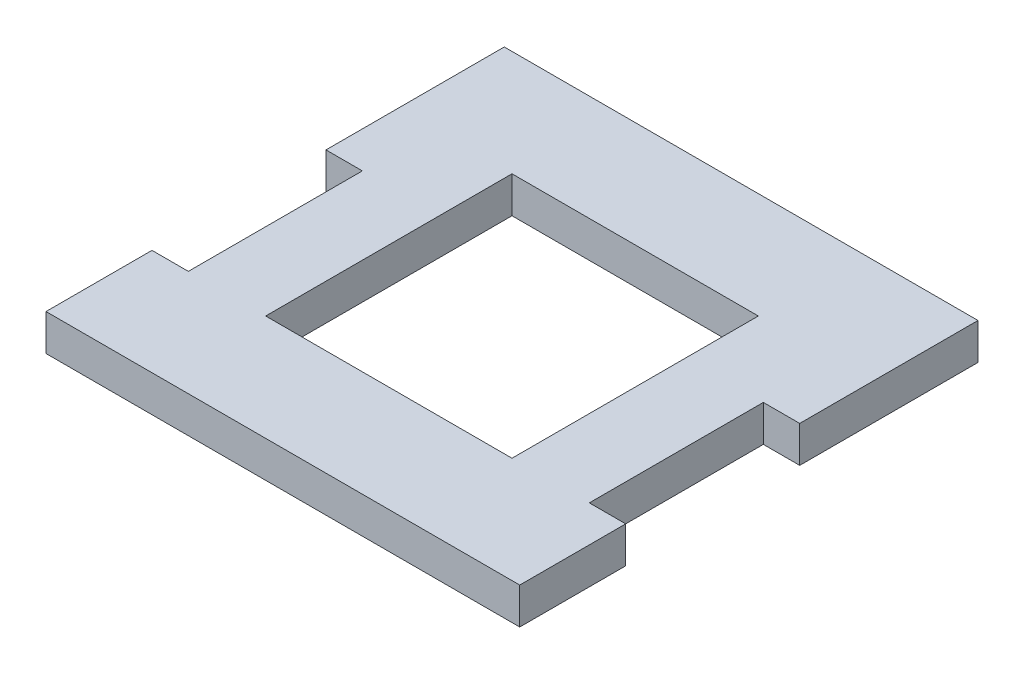
ISO-10303-21;
HEADER;
FILE_DESCRIPTION(('STEP AP214'),'2;1');
FILE_NAME('part.step','',(''),(''),'','','');
FILE_SCHEMA(('AUTOMOTIVE_DESIGN { 1 0 10303 214 1 1 1 1 }'));
ENDSEC;
DATA;
#1=APPLICATION_CONTEXT('core data for automotive mechanical design processes');
#2=APPLICATION_PROTOCOL_DEFINITION('international standard','automotive_design',2000,#1);
#3=PRODUCT_CONTEXT('',#1,'mechanical');
#4=PRODUCT('Part','Part','',(#3));
#5=PRODUCT_RELATED_PRODUCT_CATEGORY('part','',(#4));
#6=PRODUCT_DEFINITION_FORMATION('','',#4);
#7=PRODUCT_DEFINITION_CONTEXT('part definition',#1,'design');
#8=PRODUCT_DEFINITION('design','',#6,#7);
#9=PRODUCT_DEFINITION_SHAPE('','',#8);
#10=(LENGTH_UNIT() NAMED_UNIT(*) SI_UNIT(.MILLI.,.METRE.));
#11=(NAMED_UNIT(*) PLANE_ANGLE_UNIT() SI_UNIT($,.RADIAN.));
#12=(NAMED_UNIT(*) SI_UNIT($,.STERADIAN.) SOLID_ANGLE_UNIT());
#13=UNCERTAINTY_MEASURE_WITH_UNIT(LENGTH_MEASURE(1.E-05),#10,'distance_accuracy_value','');
#14=(GEOMETRIC_REPRESENTATION_CONTEXT(3) GLOBAL_UNCERTAINTY_ASSIGNED_CONTEXT((#13)) GLOBAL_UNIT_ASSIGNED_CONTEXT((#10,
#11,#12)) REPRESENTATION_CONTEXT('',''));
#15=CARTESIAN_POINT('',(0.,0.,0.));
#16=DIRECTION('',(0.,0.,1.));
#17=DIRECTION('',(1.,0.,0.));
#18=AXIS2_PLACEMENT_3D('',#15,#16,#17);
#19=CARTESIAN_POINT('',(0.,3.175,0.));
#20=DIRECTION('',(1.,0.,0.));
#21=DIRECTION('',(0.,0.,-1.));
#22=AXIS2_PLACEMENT_3D('',#19,#20,#21);
#23=PLANE('',#22);
#24=DIRECTION('',(0.,0.,1.));
#25=VECTOR('',#24,1.);
#26=CARTESIAN_POINT('',(0.,3.175,0.));
#27=LINE('',#26,#25);
#28=CARTESIAN_POINT('',(0.,3.175,-9.25000000000001));
#29=VERTEX_POINT('',#28);
#30=CARTESIAN_POINT('',(0.,3.175,0.));
#31=VERTEX_POINT('',#30);
#32=EDGE_CURVE('E240',#29,#31,#27,.T.);
#33=ORIENTED_EDGE('',*,*,#32,.F.);
#34=DIRECTION('',(0.,1.,0.));
#35=VECTOR('',#34,1.);
#36=CARTESIAN_POINT('',(0.,0.,-9.25000000000001));
#37=LINE('',#36,#35);
#38=CARTESIAN_POINT('',(0.,0.,-9.25000000000001));
#39=VERTEX_POINT('',#38);
#40=EDGE_CURVE('E178',#39,#29,#37,.T.);
#41=ORIENTED_EDGE('',*,*,#40,.F.);
#42=DIRECTION('',(0.,0.,1.));
#43=VECTOR('',#42,1.);
#44=CARTESIAN_POINT('',(0.,0.,0.));
#45=LINE('',#44,#43);
#46=CARTESIAN_POINT('',(0.,0.,0.));
#47=VERTEX_POINT('',#46);
#48=EDGE_CURVE('E235',#39,#47,#45,.T.);
#49=ORIENTED_EDGE('',*,*,#48,.T.);
#50=DIRECTION('',(0.,-1.,0.));
#51=VECTOR('',#50,1.);
#52=CARTESIAN_POINT('',(0.,3.175,0.));
#53=LINE('',#52,#51);
#54=EDGE_CURVE('E11',#31,#47,#53,.T.);
#55=ORIENTED_EDGE('',*,*,#54,.F.);
#56=EDGE_LOOP('',(#33,#41,#49,#55));
#57=FACE_BOUND('',#56,.T.);
#58=ADVANCED_FACE('F33',(#57),#23,.F.);
#59=CARTESIAN_POINT('',(41.35,3.175,0.));
#60=DIRECTION('',(-1.,0.,0.));
#61=DIRECTION('',(0.,0.,1.));
#62=AXIS2_PLACEMENT_3D('',#59,#60,#61);
#63=PLANE('',#62);
#64=DIRECTION('',(0.,0.,-1.));
#65=VECTOR('',#64,1.);
#66=CARTESIAN_POINT('',(41.35,3.175,0.));
#67=LINE('',#66,#65);
#68=CARTESIAN_POINT('',(41.35,3.175,-24.438));
#69=VERTEX_POINT('',#68);
#70=CARTESIAN_POINT('',(41.35,3.175,-40.));
#71=VERTEX_POINT('',#70);
#72=EDGE_CURVE('E242',#69,#71,#67,.T.);
#73=ORIENTED_EDGE('',*,*,#72,.F.);
#74=DIRECTION('',(0.,1.,0.));
#75=VECTOR('',#74,1.);
#76=CARTESIAN_POINT('',(41.35,0.,-24.438));
#77=LINE('',#76,#75);
#78=CARTESIAN_POINT('',(41.35,0.,-24.438));
#79=VERTEX_POINT('',#78);
#80=EDGE_CURVE('E200',#79,#69,#77,.T.);
#81=ORIENTED_EDGE('',*,*,#80,.F.);
#82=DIRECTION('',(0.,0.,-1.));
#83=VECTOR('',#82,1.);
#84=CARTESIAN_POINT('',(41.35,0.,0.));
#85=LINE('',#84,#83);
#86=CARTESIAN_POINT('',(41.35,0.,-40.));
#87=VERTEX_POINT('',#86);
#88=EDGE_CURVE('E253',#79,#87,#85,.T.);
#89=ORIENTED_EDGE('',*,*,#88,.T.);
#90=DIRECTION('',(0.,-1.,0.));
#91=VECTOR('',#90,1.);
#92=CARTESIAN_POINT('',(41.35,3.175,-40.));
#93=LINE('',#92,#91);
#94=EDGE_CURVE('E261',#71,#87,#93,.T.);
#95=ORIENTED_EDGE('',*,*,#94,.F.);
#96=EDGE_LOOP('',(#73,#81,#89,#95));
#97=FACE_BOUND('',#96,.T.);
#98=ADVANCED_FACE('F298',(#97),#63,.F.);
#99=CARTESIAN_POINT('',(0.,3.175,0.));
#100=DIRECTION('',(0.,-1.,0.));
#101=DIRECTION('',(0.,0.,-1.));
#102=AXIS2_PLACEMENT_3D('',#99,#100,#101);
#103=PLANE('',#102);
#104=DIRECTION('',(0.,0.,-1.));
#105=VECTOR('',#104,1.);
#106=CARTESIAN_POINT('',(3.175,3.175,-24.438));
#107=LINE('',#106,#105);
#108=CARTESIAN_POINT('',(3.175,3.175,-9.25000000000001));
#109=VERTEX_POINT('',#108);
#110=CARTESIAN_POINT('',(3.175,3.175,-24.438));
#111=VERTEX_POINT('',#110);
#112=EDGE_CURVE('E153',#109,#111,#107,.T.);
#113=ORIENTED_EDGE('',*,*,#112,.F.);
#114=DIRECTION('',(1.,0.,0.));
#115=VECTOR('',#114,1.);
#116=CARTESIAN_POINT('',(3.175,3.175,-9.25000000000001));
#117=LINE('',#116,#115);
#118=EDGE_CURVE('E167',#29,#109,#117,.T.);
#119=ORIENTED_EDGE('',*,*,#118,.F.);
#120=ORIENTED_EDGE('',*,*,#32,.T.);
#121=DIRECTION('',(1.,0.,0.));
#122=VECTOR('',#121,1.);
#123=CARTESIAN_POINT('',(0.,3.175,0.));
#124=LINE('',#123,#122);
#125=CARTESIAN_POINT('',(41.35,3.175,0.));
#126=VERTEX_POINT('',#125);
#127=EDGE_CURVE('E239',#31,#126,#124,.T.);
#128=ORIENTED_EDGE('',*,*,#127,.T.);
#129=CARTESIAN_POINT('',(41.35,3.175,-9.25000000000001));
#130=VERTEX_POINT('',#129);
#131=EDGE_CURVE('E243',#126,#130,#67,.T.);
#132=ORIENTED_EDGE('',*,*,#131,.T.);
#133=DIRECTION('',(1.,0.,0.));
#134=VECTOR('',#133,1.);
#135=CARTESIAN_POINT('',(38.175,3.175,-9.25000000000001));
#136=LINE('',#135,#134);
#137=CARTESIAN_POINT('',(38.175,3.175,-9.25000000000001));
#138=VERTEX_POINT('',#137);
#139=EDGE_CURVE('E56',#138,#130,#136,.T.);
#140=ORIENTED_EDGE('',*,*,#139,.F.);
#141=DIRECTION('',(0.,0.,1.));
#142=VECTOR('',#141,1.);
#143=CARTESIAN_POINT('',(38.175,3.175,-24.438));
#144=LINE('',#143,#142);
#145=CARTESIAN_POINT('',(38.175,3.175,-24.438));
#146=VERTEX_POINT('',#145);
#147=EDGE_CURVE('E177',#146,#138,#144,.T.);
#148=ORIENTED_EDGE('',*,*,#147,.F.);
#149=DIRECTION('',(-1.,0.,0.));
#150=VECTOR('',#149,1.);
#151=CARTESIAN_POINT('',(38.175,3.175,-24.438));
#152=LINE('',#151,#150);
#153=EDGE_CURVE('E185',#69,#146,#152,.T.);
#154=ORIENTED_EDGE('',*,*,#153,.F.);
#155=ORIENTED_EDGE('',*,*,#72,.T.);
#156=DIRECTION('',(-1.,0.,0.));
#157=VECTOR('',#156,1.);
#158=CARTESIAN_POINT('',(0.,3.175,-40.));
#159=LINE('',#158,#157);
#160=CARTESIAN_POINT('',(0.,3.175,-40.));
#161=VERTEX_POINT('',#160);
#162=EDGE_CURVE('E246',#71,#161,#159,.T.);
#163=ORIENTED_EDGE('',*,*,#162,.T.);
#164=CARTESIAN_POINT('',(0.,3.175,-24.438));
#165=VERTEX_POINT('',#164);
#166=EDGE_CURVE('E236',#161,#165,#27,.T.);
#167=ORIENTED_EDGE('',*,*,#166,.T.);
#168=DIRECTION('',(-1.,0.,0.));
#169=VECTOR('',#168,1.);
#170=CARTESIAN_POINT('',(3.175,3.175,-24.438));
#171=LINE('',#170,#169);
#172=EDGE_CURVE('E48',#111,#165,#171,.T.);
#173=ORIENTED_EDGE('',*,*,#172,.F.);
#174=EDGE_LOOP('',(#113,#119,#120,#128,#132,#140,#148,#154,#155,#163,#167,#173));
#175=FACE_BOUND('',#174,.T.);
#176=DIRECTION('',(0.,0.,1.));
#177=VECTOR('',#176,1.);
#178=CARTESIAN_POINT('',(9.925,3.175,-9.25000000000001));
#179=LINE('',#178,#177);
#180=CARTESIAN_POINT('',(9.925,3.175,-30.75));
#181=VERTEX_POINT('',#180);
#182=CARTESIAN_POINT('',(9.925,3.175,-9.25000000000001));
#183=VERTEX_POINT('',#182);
#184=EDGE_CURVE('E205',#181,#183,#179,.T.);
#185=ORIENTED_EDGE('',*,*,#184,.F.);
#186=DIRECTION('',(-1.,0.,0.));
#187=VECTOR('',#186,1.);
#188=CARTESIAN_POINT('',(9.925,3.175,-30.75));
#189=LINE('',#188,#187);
#190=CARTESIAN_POINT('',(31.425,3.175,-30.75));
#191=VERTEX_POINT('',#190);
#192=EDGE_CURVE('E213',#191,#181,#189,.T.);
#193=ORIENTED_EDGE('',*,*,#192,.F.);
#194=DIRECTION('',(0.,0.,-1.));
#195=VECTOR('',#194,1.);
#196=CARTESIAN_POINT('',(31.425,3.175,-9.25000000000001));
#197=LINE('',#196,#195);
#198=CARTESIAN_POINT('',(31.425,3.175,-9.25000000000001));
#199=VERTEX_POINT('',#198);
#200=EDGE_CURVE('E210',#199,#191,#197,.T.);
#201=ORIENTED_EDGE('',*,*,#200,.F.);
#202=DIRECTION('',(1.,0.,0.));
#203=VECTOR('',#202,1.);
#204=CARTESIAN_POINT('',(9.925,3.175,-9.25000000000001));
#205=LINE('',#204,#203);
#206=EDGE_CURVE('E207',#183,#199,#205,.T.);
#207=ORIENTED_EDGE('',*,*,#206,.F.);
#208=EDGE_LOOP('',(#185,#193,#201,#207));
#209=FACE_BOUND('',#208,.T.);
#210=ADVANCED_FACE('F276',(#175,#209),#103,.F.);
#211=CARTESIAN_POINT('',(0.,0.,0.));
#212=DIRECTION('',(0.,-1.,0.));
#213=DIRECTION('',(0.,0.,-1.));
#214=AXIS2_PLACEMENT_3D('',#211,#212,#213);
#215=PLANE('',#214);
#216=DIRECTION('',(1.,0.,0.));
#217=VECTOR('',#216,1.);
#218=CARTESIAN_POINT('',(3.175,0.,-9.25000000000001));
#219=LINE('',#218,#217);
#220=CARTESIAN_POINT('',(3.175,0.,-9.25000000000001));
#221=VERTEX_POINT('',#220);
#222=EDGE_CURVE('E155',#39,#221,#219,.T.);
#223=ORIENTED_EDGE('',*,*,#222,.T.);
#224=DIRECTION('',(0.,0.,-1.));
#225=VECTOR('',#224,1.);
#226=CARTESIAN_POINT('',(3.175,0.,-24.438));
#227=LINE('',#226,#225);
#228=CARTESIAN_POINT('',(3.175,0.,-24.438));
#229=VERTEX_POINT('',#228);
#230=EDGE_CURVE('E150',#221,#229,#227,.T.);
#231=ORIENTED_EDGE('',*,*,#230,.T.);
#232=DIRECTION('',(-1.,0.,0.));
#233=VECTOR('',#232,1.);
#234=CARTESIAN_POINT('',(3.175,0.,-24.438));
#235=LINE('',#234,#233);
#236=CARTESIAN_POINT('',(0.,0.,-24.438));
#237=VERTEX_POINT('',#236);
#238=EDGE_CURVE('E158',#229,#237,#235,.T.);
#239=ORIENTED_EDGE('',*,*,#238,.T.);
#240=CARTESIAN_POINT('',(0.,0.,-40.));
#241=VERTEX_POINT('',#240);
#242=EDGE_CURVE('E249',#241,#237,#45,.T.);
#243=ORIENTED_EDGE('',*,*,#242,.F.);
#244=DIRECTION('',(-1.,0.,0.));
#245=VECTOR('',#244,1.);
#246=CARTESIAN_POINT('',(0.,0.,-40.));
#247=LINE('',#246,#245);
#248=EDGE_CURVE('E257',#87,#241,#247,.T.);
#249=ORIENTED_EDGE('',*,*,#248,.F.);
#250=ORIENTED_EDGE('',*,*,#88,.F.);
#251=DIRECTION('',(-1.,0.,0.));
#252=VECTOR('',#251,1.);
#253=CARTESIAN_POINT('',(38.175,0.,-24.438));
#254=LINE('',#253,#252);
#255=CARTESIAN_POINT('',(38.175,0.,-24.438));
#256=VERTEX_POINT('',#255);
#257=EDGE_CURVE('E188',#79,#256,#254,.T.);
#258=ORIENTED_EDGE('',*,*,#257,.T.);
#259=DIRECTION('',(0.,0.,1.));
#260=VECTOR('',#259,1.);
#261=CARTESIAN_POINT('',(38.175,0.,-24.438));
#262=LINE('',#261,#260);
#263=CARTESIAN_POINT('',(38.175,0.,-9.25000000000001));
#264=VERTEX_POINT('',#263);
#265=EDGE_CURVE('E181',#256,#264,#262,.T.);
#266=ORIENTED_EDGE('',*,*,#265,.T.);
#267=DIRECTION('',(1.,0.,0.));
#268=VECTOR('',#267,1.);
#269=CARTESIAN_POINT('',(38.175,0.,-9.25000000000001));
#270=LINE('',#269,#268);
#271=CARTESIAN_POINT('',(41.35,0.,-9.25000000000001));
#272=VERTEX_POINT('',#271);
#273=EDGE_CURVE('E184',#264,#272,#270,.T.);
#274=ORIENTED_EDGE('',*,*,#273,.T.);
#275=CARTESIAN_POINT('',(41.35,0.,0.));
#276=VERTEX_POINT('',#275);
#277=EDGE_CURVE('E254',#276,#272,#85,.T.);
#278=ORIENTED_EDGE('',*,*,#277,.F.);
#279=DIRECTION('',(1.,0.,0.));
#280=VECTOR('',#279,1.);
#281=CARTESIAN_POINT('',(0.,0.,0.));
#282=LINE('',#281,#280);
#283=EDGE_CURVE('E251',#47,#276,#282,.T.);
#284=ORIENTED_EDGE('',*,*,#283,.F.);
#285=ORIENTED_EDGE('',*,*,#48,.F.);
#286=EDGE_LOOP('',(#223,#231,#239,#243,#249,#250,#258,#266,#274,#278,#284,#285));
#287=FACE_BOUND('',#286,.T.);
#288=DIRECTION('',(-1.,0.,0.));
#289=VECTOR('',#288,1.);
#290=CARTESIAN_POINT('',(9.925,0.,-30.75));
#291=LINE('',#290,#289);
#292=CARTESIAN_POINT('',(31.425,0.,-30.75));
#293=VERTEX_POINT('',#292);
#294=CARTESIAN_POINT('',(9.925,0.,-30.75));
#295=VERTEX_POINT('',#294);
#296=EDGE_CURVE('E208',#293,#295,#291,.T.);
#297=ORIENTED_EDGE('',*,*,#296,.T.);
#298=DIRECTION('',(0.,0.,1.));
#299=VECTOR('',#298,1.);
#300=CARTESIAN_POINT('',(9.925,0.,-9.25000000000001));
#301=LINE('',#300,#299);
#302=CARTESIAN_POINT('',(9.925,0.,-9.25000000000001));
#303=VERTEX_POINT('',#302);
#304=EDGE_CURVE('E199',#295,#303,#301,.T.);
#305=ORIENTED_EDGE('',*,*,#304,.T.);
#306=DIRECTION('',(1.,0.,0.));
#307=VECTOR('',#306,1.);
#308=CARTESIAN_POINT('',(9.925,0.,-9.25000000000001));
#309=LINE('',#308,#307);
#310=CARTESIAN_POINT('',(31.425,0.,-9.25000000000001));
#311=VERTEX_POINT('',#310);
#312=EDGE_CURVE('E218',#303,#311,#309,.T.);
#313=ORIENTED_EDGE('',*,*,#312,.T.);
#314=DIRECTION('',(0.,0.,-1.));
#315=VECTOR('',#314,1.);
#316=CARTESIAN_POINT('',(31.425,0.,-9.25000000000001));
#317=LINE('',#316,#315);
#318=EDGE_CURVE('E221',#311,#293,#317,.T.);
#319=ORIENTED_EDGE('',*,*,#318,.T.);
#320=EDGE_LOOP('',(#297,#305,#313,#319));
#321=FACE_BOUND('',#320,.T.);
#322=ADVANCED_FACE('F164',(#287,#321),#215,.T.);
#323=ORIENTED_EDGE('',*,*,#242,.T.);
#324=DIRECTION('',(0.,1.,0.));
#325=VECTOR('',#324,1.);
#326=CARTESIAN_POINT('',(0.,0.,-24.438));
#327=LINE('',#326,#325);
#328=EDGE_CURVE('E154',#237,#165,#327,.T.);
#329=ORIENTED_EDGE('',*,*,#328,.T.);
#330=ORIENTED_EDGE('',*,*,#166,.F.);
#331=DIRECTION('',(0.,-1.,0.));
#332=VECTOR('',#331,1.);
#333=CARTESIAN_POINT('',(0.,3.175,-40.));
#334=LINE('',#333,#332);
#335=EDGE_CURVE('E248',#161,#241,#334,.T.);
#336=ORIENTED_EDGE('',*,*,#335,.T.);
#337=EDGE_LOOP('',(#323,#329,#330,#336));
#338=FACE_BOUND('',#337,.T.);
#339=ADVANCED_FACE('F35',(#338),#23,.F.);
#340=CARTESIAN_POINT('',(0.,3.175,0.));
#341=DIRECTION('',(0.,0.,-1.));
#342=DIRECTION('',(-1.,0.,0.));
#343=AXIS2_PLACEMENT_3D('',#340,#341,#342);
#344=PLANE('',#343);
#345=ORIENTED_EDGE('',*,*,#283,.T.);
#346=DIRECTION('',(0.,-1.,0.));
#347=VECTOR('',#346,1.);
#348=CARTESIAN_POINT('',(41.35,3.175,0.));
#349=LINE('',#348,#347);
#350=EDGE_CURVE('E41',#126,#276,#349,.T.);
#351=ORIENTED_EDGE('',*,*,#350,.F.);
#352=ORIENTED_EDGE('',*,*,#127,.F.);
#353=ORIENTED_EDGE('',*,*,#54,.T.);
#354=EDGE_LOOP('',(#345,#351,#352,#353));
#355=FACE_BOUND('',#354,.T.);
#356=ADVANCED_FACE('F282',(#355),#344,.F.);
#357=ORIENTED_EDGE('',*,*,#277,.T.);
#358=DIRECTION('',(0.,1.,0.));
#359=VECTOR('',#358,1.);
#360=CARTESIAN_POINT('',(41.35,0.,-9.25000000000001));
#361=LINE('',#360,#359);
#362=EDGE_CURVE('E202',#272,#130,#361,.T.);
#363=ORIENTED_EDGE('',*,*,#362,.T.);
#364=ORIENTED_EDGE('',*,*,#131,.F.);
#365=ORIENTED_EDGE('',*,*,#350,.T.);
#366=EDGE_LOOP('',(#357,#363,#364,#365));
#367=FACE_BOUND('',#366,.T.);
#368=ADVANCED_FACE('F268',(#367),#63,.F.);
#369=CARTESIAN_POINT('',(0.,3.175,-40.));
#370=DIRECTION('',(0.,0.,1.));
#371=DIRECTION('',(1.,0.,0.));
#372=AXIS2_PLACEMENT_3D('',#369,#370,#371);
#373=PLANE('',#372);
#374=ORIENTED_EDGE('',*,*,#248,.T.);
#375=ORIENTED_EDGE('',*,*,#335,.F.);
#376=ORIENTED_EDGE('',*,*,#162,.F.);
#377=ORIENTED_EDGE('',*,*,#94,.T.);
#378=EDGE_LOOP('',(#374,#375,#376,#377));
#379=FACE_BOUND('',#378,.T.);
#380=ADVANCED_FACE('F294',(#379),#373,.F.);
#381=CARTESIAN_POINT('',(9.925,3.175,-9.25000000000001));
#382=DIRECTION('',(1.,0.,0.));
#383=DIRECTION('',(0.,0.,-1.));
#384=AXIS2_PLACEMENT_3D('',#381,#382,#383);
#385=PLANE('',#384);
#386=ORIENTED_EDGE('',*,*,#304,.F.);
#387=DIRECTION('',(0.,-1.,0.));
#388=VECTOR('',#387,1.);
#389=CARTESIAN_POINT('',(9.925,3.175,-30.75));
#390=LINE('',#389,#388);
#391=EDGE_CURVE('E215',#181,#295,#390,.T.);
#392=ORIENTED_EDGE('',*,*,#391,.F.);
#393=ORIENTED_EDGE('',*,*,#184,.T.);
#394=DIRECTION('',(0.,-1.,0.));
#395=VECTOR('',#394,1.);
#396=CARTESIAN_POINT('',(9.925,3.175,-9.25000000000001));
#397=LINE('',#396,#395);
#398=EDGE_CURVE('E232',#183,#303,#397,.T.);
#399=ORIENTED_EDGE('',*,*,#398,.T.);
#400=EDGE_LOOP('',(#386,#392,#393,#399));
#401=FACE_BOUND('',#400,.T.);
#402=ADVANCED_FACE('F335',(#401),#385,.T.);
#403=CARTESIAN_POINT('',(9.925,3.175,-9.25000000000001));
#404=DIRECTION('',(0.,0.,-1.));
#405=DIRECTION('',(-1.,0.,0.));
#406=AXIS2_PLACEMENT_3D('',#403,#404,#405);
#407=PLANE('',#406);
#408=ORIENTED_EDGE('',*,*,#312,.F.);
#409=ORIENTED_EDGE('',*,*,#398,.F.);
#410=ORIENTED_EDGE('',*,*,#206,.T.);
#411=DIRECTION('',(0.,-1.,0.));
#412=VECTOR('',#411,1.);
#413=CARTESIAN_POINT('',(31.425,3.175,-9.25000000000001));
#414=LINE('',#413,#412);
#415=EDGE_CURVE('E230',#199,#311,#414,.T.);
#416=ORIENTED_EDGE('',*,*,#415,.T.);
#417=EDGE_LOOP('',(#408,#409,#410,#416));
#418=FACE_BOUND('',#417,.T.);
#419=ADVANCED_FACE('F351',(#418),#407,.T.);
#420=CARTESIAN_POINT('',(31.425,3.175,-9.25000000000001));
#421=DIRECTION('',(-1.,0.,0.));
#422=DIRECTION('',(0.,0.,1.));
#423=AXIS2_PLACEMENT_3D('',#420,#421,#422);
#424=PLANE('',#423);
#425=ORIENTED_EDGE('',*,*,#318,.F.);
#426=ORIENTED_EDGE('',*,*,#415,.F.);
#427=ORIENTED_EDGE('',*,*,#200,.T.);
#428=DIRECTION('',(0.,-1.,0.));
#429=VECTOR('',#428,1.);
#430=CARTESIAN_POINT('',(31.425,3.175,-30.75));
#431=LINE('',#430,#429);
#432=EDGE_CURVE('E228',#191,#293,#431,.T.);
#433=ORIENTED_EDGE('',*,*,#432,.T.);
#434=EDGE_LOOP('',(#425,#426,#427,#433));
#435=FACE_BOUND('',#434,.T.);
#436=ADVANCED_FACE('F313',(#435),#424,.T.);
#437=CARTESIAN_POINT('',(9.925,3.175,-30.75));
#438=DIRECTION('',(0.,0.,1.));
#439=DIRECTION('',(1.,0.,0.));
#440=AXIS2_PLACEMENT_3D('',#437,#438,#439);
#441=PLANE('',#440);
#442=ORIENTED_EDGE('',*,*,#296,.F.);
#443=ORIENTED_EDGE('',*,*,#432,.F.);
#444=ORIENTED_EDGE('',*,*,#192,.T.);
#445=ORIENTED_EDGE('',*,*,#391,.T.);
#446=EDGE_LOOP('',(#442,#443,#444,#445));
#447=FACE_BOUND('',#446,.T.);
#448=ADVANCED_FACE('F306',(#447),#441,.T.);
#449=CARTESIAN_POINT('',(38.175,0.,-24.438));
#450=DIRECTION('',(-1.,0.,0.));
#451=DIRECTION('',(0.,0.,1.));
#452=AXIS2_PLACEMENT_3D('',#449,#450,#451);
#453=PLANE('',#452);
#454=ORIENTED_EDGE('',*,*,#147,.T.);
#455=DIRECTION('',(0.,1.,0.));
#456=VECTOR('',#455,1.);
#457=CARTESIAN_POINT('',(38.175,0.,-9.25000000000001));
#458=LINE('',#457,#456);
#459=EDGE_CURVE('E191',#264,#138,#458,.T.);
#460=ORIENTED_EDGE('',*,*,#459,.F.);
#461=ORIENTED_EDGE('',*,*,#265,.F.);
#462=DIRECTION('',(0.,1.,0.));
#463=VECTOR('',#462,1.);
#464=CARTESIAN_POINT('',(38.175,0.,-24.438));
#465=LINE('',#464,#463);
#466=EDGE_CURVE('E197',#256,#146,#465,.T.);
#467=ORIENTED_EDGE('',*,*,#466,.T.);
#468=EDGE_LOOP('',(#454,#460,#461,#467));
#469=FACE_BOUND('',#468,.T.);
#470=ADVANCED_FACE('F304',(#469),#453,.F.);
#471=CARTESIAN_POINT('',(38.175,0.,-24.438));
#472=DIRECTION('',(0.,0.,-1.));
#473=DIRECTION('',(-1.,0.,0.));
#474=AXIS2_PLACEMENT_3D('',#471,#472,#473);
#475=PLANE('',#474);
#476=ORIENTED_EDGE('',*,*,#153,.T.);
#477=ORIENTED_EDGE('',*,*,#466,.F.);
#478=ORIENTED_EDGE('',*,*,#257,.F.);
#479=ORIENTED_EDGE('',*,*,#80,.T.);
#480=EDGE_LOOP('',(#476,#477,#478,#479));
#481=FACE_BOUND('',#480,.T.);
#482=ADVANCED_FACE('F302',(#481),#475,.F.);
#483=CARTESIAN_POINT('',(38.175,0.,-9.25000000000001));
#484=DIRECTION('',(0.,0.,1.));
#485=DIRECTION('',(1.,0.,0.));
#486=AXIS2_PLACEMENT_3D('',#483,#484,#485);
#487=PLANE('',#486);
#488=ORIENTED_EDGE('',*,*,#139,.T.);
#489=ORIENTED_EDGE('',*,*,#362,.F.);
#490=ORIENTED_EDGE('',*,*,#273,.F.);
#491=ORIENTED_EDGE('',*,*,#459,.T.);
#492=EDGE_LOOP('',(#488,#489,#490,#491));
#493=FACE_BOUND('',#492,.T.);
#494=ADVANCED_FACE('F274',(#493),#487,.F.);
#495=CARTESIAN_POINT('',(3.175,0.,-24.438));
#496=DIRECTION('',(1.,0.,0.));
#497=DIRECTION('',(0.,0.,-1.));
#498=AXIS2_PLACEMENT_3D('',#495,#496,#497);
#499=PLANE('',#498);
#500=ORIENTED_EDGE('',*,*,#112,.T.);
#501=DIRECTION('',(0.,1.,0.));
#502=VECTOR('',#501,1.);
#503=CARTESIAN_POINT('',(3.175,0.,-24.438));
#504=LINE('',#503,#502);
#505=EDGE_CURVE('E146',#229,#111,#504,.T.);
#506=ORIENTED_EDGE('',*,*,#505,.F.);
#507=ORIENTED_EDGE('',*,*,#230,.F.);
#508=DIRECTION('',(0.,1.,0.));
#509=VECTOR('',#508,1.);
#510=CARTESIAN_POINT('',(3.175,0.,-9.25000000000001));
#511=LINE('',#510,#509);
#512=EDGE_CURVE('E175',#221,#109,#511,.T.);
#513=ORIENTED_EDGE('',*,*,#512,.T.);
#514=EDGE_LOOP('',(#500,#506,#507,#513));
#515=FACE_BOUND('',#514,.T.);
#516=ADVANCED_FACE('F148',(#515),#499,.F.);
#517=CARTESIAN_POINT('',(3.175,0.,-9.25000000000001));
#518=DIRECTION('',(0.,0.,1.));
#519=DIRECTION('',(1.,0.,0.));
#520=AXIS2_PLACEMENT_3D('',#517,#518,#519);
#521=PLANE('',#520);
#522=ORIENTED_EDGE('',*,*,#118,.T.);
#523=ORIENTED_EDGE('',*,*,#512,.F.);
#524=ORIENTED_EDGE('',*,*,#222,.F.);
#525=ORIENTED_EDGE('',*,*,#40,.T.);
#526=EDGE_LOOP('',(#522,#523,#524,#525));
#527=FACE_BOUND('',#526,.T.);
#528=ADVANCED_FACE('F286',(#527),#521,.F.);
#529=CARTESIAN_POINT('',(3.175,0.,-24.438));
#530=DIRECTION('',(0.,0.,-1.));
#531=DIRECTION('',(-1.,0.,0.));
#532=AXIS2_PLACEMENT_3D('',#529,#530,#531);
#533=PLANE('',#532);
#534=ORIENTED_EDGE('',*,*,#172,.T.);
#535=ORIENTED_EDGE('',*,*,#328,.F.);
#536=ORIENTED_EDGE('',*,*,#238,.F.);
#537=ORIENTED_EDGE('',*,*,#505,.T.);
#538=EDGE_LOOP('',(#534,#535,#536,#537));
#539=FACE_BOUND('',#538,.T.);
#540=ADVANCED_FACE('F159',(#539),#533,.F.);
#541=CLOSED_SHELL('',(#58,#98,#210,#322,#339,#356,#368,#380,#402,#419,#436,#448,#470,#482,#494,
#516,#528,#540));
#542=MANIFOLD_SOLID_BREP('B2',#541);
#543=ADVANCED_BREP_SHAPE_REPRESENTATION('',(#18,#542),#14);
#544=SHAPE_DEFINITION_REPRESENTATION(#9,#543);
ENDSEC;
END-ISO-10303-21;
